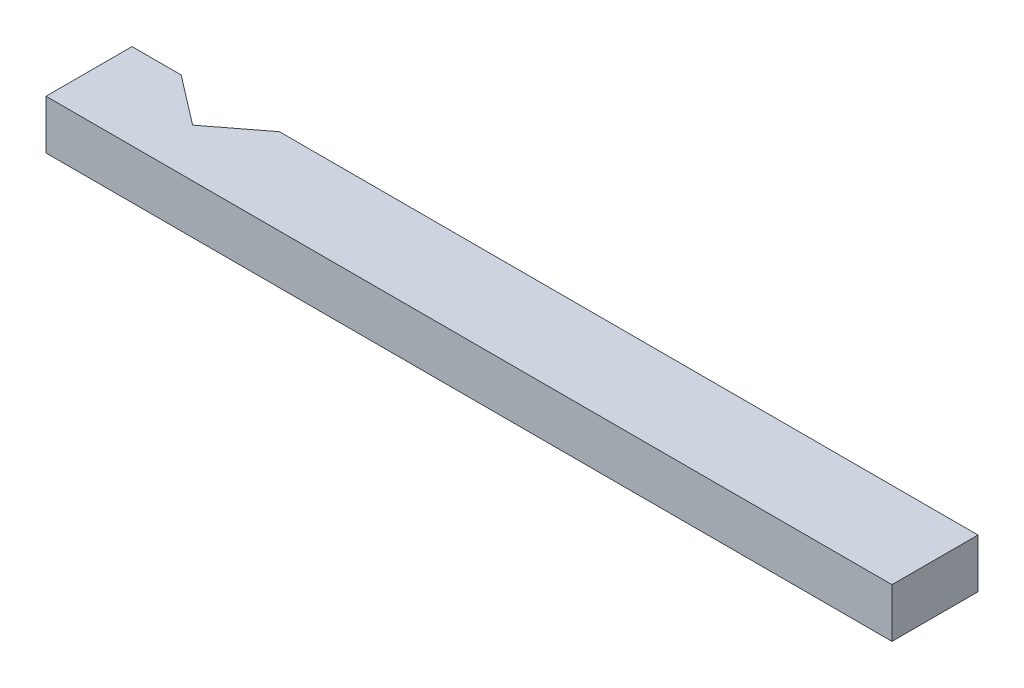
ISO-10303-21;
HEADER;
FILE_DESCRIPTION(('STEP AP214'),'2;1');
FILE_NAME('part.step','',(''),(''),'','','');
FILE_SCHEMA(('AUTOMOTIVE_DESIGN { 1 0 10303 214 1 1 1 1 }'));
ENDSEC;
DATA;
#1=APPLICATION_CONTEXT('core data for automotive mechanical design processes');
#2=APPLICATION_PROTOCOL_DEFINITION('international standard','automotive_design',2000,#1);
#3=PRODUCT_CONTEXT('',#1,'mechanical');
#4=PRODUCT('Part','Part','',(#3));
#5=PRODUCT_RELATED_PRODUCT_CATEGORY('part','',(#4));
#6=PRODUCT_DEFINITION_FORMATION('','',#4);
#7=PRODUCT_DEFINITION_CONTEXT('part definition',#1,'design');
#8=PRODUCT_DEFINITION('design','',#6,#7);
#9=PRODUCT_DEFINITION_SHAPE('','',#8);
#10=(LENGTH_UNIT() NAMED_UNIT(*) SI_UNIT(.MILLI.,.METRE.));
#11=(NAMED_UNIT(*) PLANE_ANGLE_UNIT() SI_UNIT($,.RADIAN.));
#12=(NAMED_UNIT(*) SI_UNIT($,.STERADIAN.) SOLID_ANGLE_UNIT());
#13=UNCERTAINTY_MEASURE_WITH_UNIT(LENGTH_MEASURE(1.E-05),#10,'distance_accuracy_value','');
#14=(GEOMETRIC_REPRESENTATION_CONTEXT(3) GLOBAL_UNCERTAINTY_ASSIGNED_CONTEXT((#13)) GLOBAL_UNIT_ASSIGNED_CONTEXT((#10,
#11,#12)) REPRESENTATION_CONTEXT('',''));
#15=CARTESIAN_POINT('',(0.,0.,0.));
#16=DIRECTION('',(0.,0.,1.));
#17=DIRECTION('',(1.,0.,0.));
#18=AXIS2_PLACEMENT_3D('',#15,#16,#17);
#19=CARTESIAN_POINT('',(-437.1975,25.4,-44.45));
#20=DIRECTION('',(0.,0.,1.));
#21=DIRECTION('',(1.,0.,0.));
#22=AXIS2_PLACEMENT_3D('',#19,#20,#21);
#23=PLANE('',#22);
#24=DIRECTION('',(-1.,0.,0.));
#25=VECTOR('',#24,1.);
#26=CARTESIAN_POINT('',(-437.1975,-25.4,-44.45));
#27=LINE('',#26,#25);
#28=CARTESIAN_POINT('',(437.1975,-25.4,-44.45));
#29=VERTEX_POINT('',#28);
#30=CARTESIAN_POINT('',(-284.7975,-25.4,-44.45));
#31=VERTEX_POINT('',#30);
#32=EDGE_CURVE('E137',#29,#31,#27,.T.);
#33=ORIENTED_EDGE('',*,*,#32,.T.);
#34=DIRECTION('',(0.,1.,0.));
#35=VECTOR('',#34,1.);
#36=CARTESIAN_POINT('',(-284.7975,-25.4,-44.45));
#37=LINE('',#36,#35);
#38=CARTESIAN_POINT('',(-284.7975,25.4,-44.45));
#39=VERTEX_POINT('',#38);
#40=EDGE_CURVE('E144',#31,#39,#37,.T.);
#41=ORIENTED_EDGE('',*,*,#40,.T.);
#42=DIRECTION('',(-1.,0.,0.));
#43=VECTOR('',#42,1.);
#44=CARTESIAN_POINT('',(-437.1975,25.4,-44.45));
#45=LINE('',#44,#43);
#46=CARTESIAN_POINT('',(437.1975,25.4,-44.45));
#47=VERTEX_POINT('',#46);
#48=EDGE_CURVE('E96',#47,#39,#45,.T.);
#49=ORIENTED_EDGE('',*,*,#48,.F.);
#50=DIRECTION('',(0.,-1.,0.));
#51=VECTOR('',#50,1.);
#52=CARTESIAN_POINT('',(437.1975,25.4,-44.45));
#53=LINE('',#52,#51);
#54=EDGE_CURVE('E11',#47,#29,#53,.T.);
#55=ORIENTED_EDGE('',*,*,#54,.T.);
#56=EDGE_LOOP('',(#33,#41,#49,#55));
#57=FACE_BOUND('',#56,.T.);
#58=ADVANCED_FACE('F43',(#57),#23,.F.);
#59=CARTESIAN_POINT('',(437.1975,25.4,44.45));
#60=DIRECTION('',(-1.,0.,0.));
#61=DIRECTION('',(0.,0.,1.));
#62=AXIS2_PLACEMENT_3D('',#59,#60,#61);
#63=PLANE('',#62);
#64=DIRECTION('',(0.,0.,-1.));
#65=VECTOR('',#64,1.);
#66=CARTESIAN_POINT('',(437.1975,-25.4,44.45));
#67=LINE('',#66,#65);
#68=CARTESIAN_POINT('',(437.1975,-25.4,44.45));
#69=VERTEX_POINT('',#68);
#70=EDGE_CURVE('E138',#69,#29,#67,.T.);
#71=ORIENTED_EDGE('',*,*,#70,.T.);
#72=ORIENTED_EDGE('',*,*,#54,.F.);
#73=DIRECTION('',(0.,0.,-1.));
#74=VECTOR('',#73,1.);
#75=CARTESIAN_POINT('',(437.1975,25.4,44.45));
#76=LINE('',#75,#74);
#77=CARTESIAN_POINT('',(437.1975,25.4,44.45));
#78=VERTEX_POINT('',#77);
#79=EDGE_CURVE('E152',#78,#47,#76,.T.);
#80=ORIENTED_EDGE('',*,*,#79,.F.);
#81=DIRECTION('',(0.,-1.,0.));
#82=VECTOR('',#81,1.);
#83=CARTESIAN_POINT('',(437.1975,25.4,44.45));
#84=LINE('',#83,#82);
#85=EDGE_CURVE('E153',#78,#69,#84,.T.);
#86=ORIENTED_EDGE('',*,*,#85,.T.);
#87=EDGE_LOOP('',(#71,#72,#80,#86));
#88=FACE_BOUND('',#87,.T.);
#89=ADVANCED_FACE('F45',(#88),#63,.F.);
#90=CARTESIAN_POINT('',(-386.3975,25.4,-44.45));
#91=VERTEX_POINT('',#90);
#92=CARTESIAN_POINT('',(-437.1975,25.4,-44.45));
#93=VERTEX_POINT('',#92);
#94=EDGE_CURVE('E130',#91,#93,#45,.T.);
#95=ORIENTED_EDGE('',*,*,#94,.F.);
#96=DIRECTION('',(0.,1.,0.));
#97=VECTOR('',#96,1.);
#98=CARTESIAN_POINT('',(-386.3975,-25.4,-44.45));
#99=LINE('',#98,#97);
#100=CARTESIAN_POINT('',(-386.3975,-25.4,-44.45));
#101=VERTEX_POINT('',#100);
#102=EDGE_CURVE('E116',#101,#91,#99,.T.);
#103=ORIENTED_EDGE('',*,*,#102,.F.);
#104=CARTESIAN_POINT('',(-437.1975,-25.4,-44.45));
#105=VERTEX_POINT('',#104);
#106=EDGE_CURVE('E128',#101,#105,#27,.T.);
#107=ORIENTED_EDGE('',*,*,#106,.T.);
#108=DIRECTION('',(0.,-1.,0.));
#109=VECTOR('',#108,1.);
#110=CARTESIAN_POINT('',(-437.1975,25.4,-44.45));
#111=LINE('',#110,#109);
#112=EDGE_CURVE('E52',#93,#105,#111,.T.);
#113=ORIENTED_EDGE('',*,*,#112,.F.);
#114=EDGE_LOOP('',(#95,#103,#107,#113));
#115=FACE_BOUND('',#114,.T.);
#116=ADVANCED_FACE('F126',(#115),#23,.F.);
#117=CARTESIAN_POINT('',(-437.1975,25.4,44.45));
#118=DIRECTION('',(1.,0.,0.));
#119=DIRECTION('',(0.,0.,-1.));
#120=AXIS2_PLACEMENT_3D('',#117,#118,#119);
#121=PLANE('',#120);
#122=DIRECTION('',(0.,0.,1.));
#123=VECTOR('',#122,1.);
#124=CARTESIAN_POINT('',(-437.1975,-25.4,44.45));
#125=LINE('',#124,#123);
#126=CARTESIAN_POINT('',(-437.1975,-25.4,44.45));
#127=VERTEX_POINT('',#126);
#128=EDGE_CURVE('E135',#105,#127,#125,.T.);
#129=ORIENTED_EDGE('',*,*,#128,.T.);
#130=DIRECTION('',(0.,-1.,0.));
#131=VECTOR('',#130,1.);
#132=CARTESIAN_POINT('',(-437.1975,25.4,44.45));
#133=LINE('',#132,#131);
#134=CARTESIAN_POINT('',(-437.1975,25.4,44.45));
#135=VERTEX_POINT('',#134);
#136=EDGE_CURVE('E156',#135,#127,#133,.T.);
#137=ORIENTED_EDGE('',*,*,#136,.F.);
#138=DIRECTION('',(0.,0.,1.));
#139=VECTOR('',#138,1.);
#140=CARTESIAN_POINT('',(-437.1975,25.4,44.45));
#141=LINE('',#140,#139);
#142=EDGE_CURVE('E163',#93,#135,#141,.T.);
#143=ORIENTED_EDGE('',*,*,#142,.F.);
#144=ORIENTED_EDGE('',*,*,#112,.T.);
#145=EDGE_LOOP('',(#129,#137,#143,#144));
#146=FACE_BOUND('',#145,.T.);
#147=ADVANCED_FACE('F161',(#146),#121,.F.);
#148=CARTESIAN_POINT('',(-437.1975,25.4,44.45));
#149=DIRECTION('',(0.,0.,-1.));
#150=DIRECTION('',(-1.,0.,0.));
#151=AXIS2_PLACEMENT_3D('',#148,#149,#150);
#152=PLANE('',#151);
#153=DIRECTION('',(1.,0.,0.));
#154=VECTOR('',#153,1.);
#155=CARTESIAN_POINT('',(-437.1975,-25.4,44.45));
#156=LINE('',#155,#154);
#157=EDGE_CURVE('E89',#127,#69,#156,.T.);
#158=ORIENTED_EDGE('',*,*,#157,.T.);
#159=ORIENTED_EDGE('',*,*,#85,.F.);
#160=DIRECTION('',(1.,0.,0.));
#161=VECTOR('',#160,1.);
#162=CARTESIAN_POINT('',(-437.1975,25.4,44.45));
#163=LINE('',#162,#161);
#164=EDGE_CURVE('E68',#135,#78,#163,.T.);
#165=ORIENTED_EDGE('',*,*,#164,.F.);
#166=ORIENTED_EDGE('',*,*,#136,.T.);
#167=EDGE_LOOP('',(#158,#159,#165,#166));
#168=FACE_BOUND('',#167,.T.);
#169=ADVANCED_FACE('F186',(#168),#152,.F.);
#170=CARTESIAN_POINT('',(0.,25.4,0.));
#171=DIRECTION('',(0.,-1.,0.));
#172=DIRECTION('',(0.,0.,-1.));
#173=AXIS2_PLACEMENT_3D('',#170,#171,#172);
#174=PLANE('',#173);
#175=ORIENTED_EDGE('',*,*,#48,.T.);
#176=DIRECTION('',(0.793353340291234,0.,-0.608761429008722));
#177=VECTOR('',#176,1.);
#178=CARTESIAN_POINT('',(-335.5975,25.4,-5.46978901066869));
#179=LINE('',#178,#177);
#180=CARTESIAN_POINT('',(-335.5975,25.4,-5.46978901066869));
#181=VERTEX_POINT('',#180);
#182=EDGE_CURVE('E122',#181,#39,#179,.T.);
#183=ORIENTED_EDGE('',*,*,#182,.F.);
#184=DIRECTION('',(0.793353340291234,0.,0.608761429008722));
#185=VECTOR('',#184,1.);
#186=CARTESIAN_POINT('',(-386.3975,25.4,-44.45));
#187=LINE('',#186,#185);
#188=EDGE_CURVE('E178',#91,#181,#187,.T.);
#189=ORIENTED_EDGE('',*,*,#188,.F.);
#190=ORIENTED_EDGE('',*,*,#94,.T.);
#191=ORIENTED_EDGE('',*,*,#142,.T.);
#192=ORIENTED_EDGE('',*,*,#164,.T.);
#193=ORIENTED_EDGE('',*,*,#79,.T.);
#194=EDGE_LOOP('',(#175,#183,#189,#190,#191,#192,#193));
#195=FACE_BOUND('',#194,.T.);
#196=ADVANCED_FACE('F188',(#195),#174,.F.);
#197=CARTESIAN_POINT('',(0.,-25.4,0.));
#198=DIRECTION('',(0.,-1.,0.));
#199=DIRECTION('',(0.,0.,-1.));
#200=AXIS2_PLACEMENT_3D('',#197,#198,#199);
#201=PLANE('',#200);
#202=DIRECTION('',(0.793353340291234,0.,-0.608761429008722));
#203=VECTOR('',#202,1.);
#204=CARTESIAN_POINT('',(-335.5975,-25.4,-5.46978901066869));
#205=LINE('',#204,#203);
#206=CARTESIAN_POINT('',(-335.5975,-25.4,-5.46978901066869));
#207=VERTEX_POINT('',#206);
#208=EDGE_CURVE('E59',#207,#31,#205,.T.);
#209=ORIENTED_EDGE('',*,*,#208,.T.);
#210=ORIENTED_EDGE('',*,*,#32,.F.);
#211=ORIENTED_EDGE('',*,*,#70,.F.);
#212=ORIENTED_EDGE('',*,*,#157,.F.);
#213=ORIENTED_EDGE('',*,*,#128,.F.);
#214=ORIENTED_EDGE('',*,*,#106,.F.);
#215=DIRECTION('',(0.793353340291234,0.,0.608761429008722));
#216=VECTOR('',#215,1.);
#217=CARTESIAN_POINT('',(-386.3975,-25.4,-44.45));
#218=LINE('',#217,#216);
#219=EDGE_CURVE('E112',#101,#207,#218,.T.);
#220=ORIENTED_EDGE('',*,*,#219,.T.);
#221=EDGE_LOOP('',(#209,#210,#211,#212,#213,#214,#220));
#222=FACE_BOUND('',#221,.T.);
#223=ADVANCED_FACE('F134',(#222),#201,.T.);
#224=CARTESIAN_POINT('',(-335.5975,-25.4,-5.46978901066869));
#225=DIRECTION('',(0.608761429008722,0.,0.793353340291234));
#226=DIRECTION('',(0.793353340291234,0.,-0.608761429008722));
#227=AXIS2_PLACEMENT_3D('',#224,#225,#226);
#228=PLANE('',#227);
#229=ORIENTED_EDGE('',*,*,#182,.T.);
#230=ORIENTED_EDGE('',*,*,#40,.F.);
#231=ORIENTED_EDGE('',*,*,#208,.F.);
#232=DIRECTION('',(0.,1.,0.));
#233=VECTOR('',#232,1.);
#234=CARTESIAN_POINT('',(-335.5975,-25.4,-5.46978901066869));
#235=LINE('',#234,#233);
#236=EDGE_CURVE('E118',#207,#181,#235,.T.);
#237=ORIENTED_EDGE('',*,*,#236,.T.);
#238=EDGE_LOOP('',(#229,#230,#231,#237));
#239=FACE_BOUND('',#238,.T.);
#240=ADVANCED_FACE('F236',(#239),#228,.F.);
#241=CARTESIAN_POINT('',(-386.3975,-25.4,-44.45));
#242=DIRECTION('',(-0.608761429008722,0.,0.793353340291234));
#243=DIRECTION('',(0.793353340291234,0.,0.608761429008722));
#244=AXIS2_PLACEMENT_3D('',#241,#242,#243);
#245=PLANE('',#244);
#246=ORIENTED_EDGE('',*,*,#188,.T.);
#247=ORIENTED_EDGE('',*,*,#236,.F.);
#248=ORIENTED_EDGE('',*,*,#219,.F.);
#249=ORIENTED_EDGE('',*,*,#102,.T.);
#250=EDGE_LOOP('',(#246,#247,#248,#249));
#251=FACE_BOUND('',#250,.T.);
#252=ADVANCED_FACE('F115',(#251),#245,.F.);
#253=CLOSED_SHELL('',(#58,#89,#116,#147,#169,#196,#223,#240,#252));
#254=MANIFOLD_SOLID_BREP('B2',#253);
#255=ADVANCED_BREP_SHAPE_REPRESENTATION('',(#18,#254),#14);
#256=SHAPE_DEFINITION_REPRESENTATION(#9,#255);
ENDSEC;
END-ISO-10303-21;
